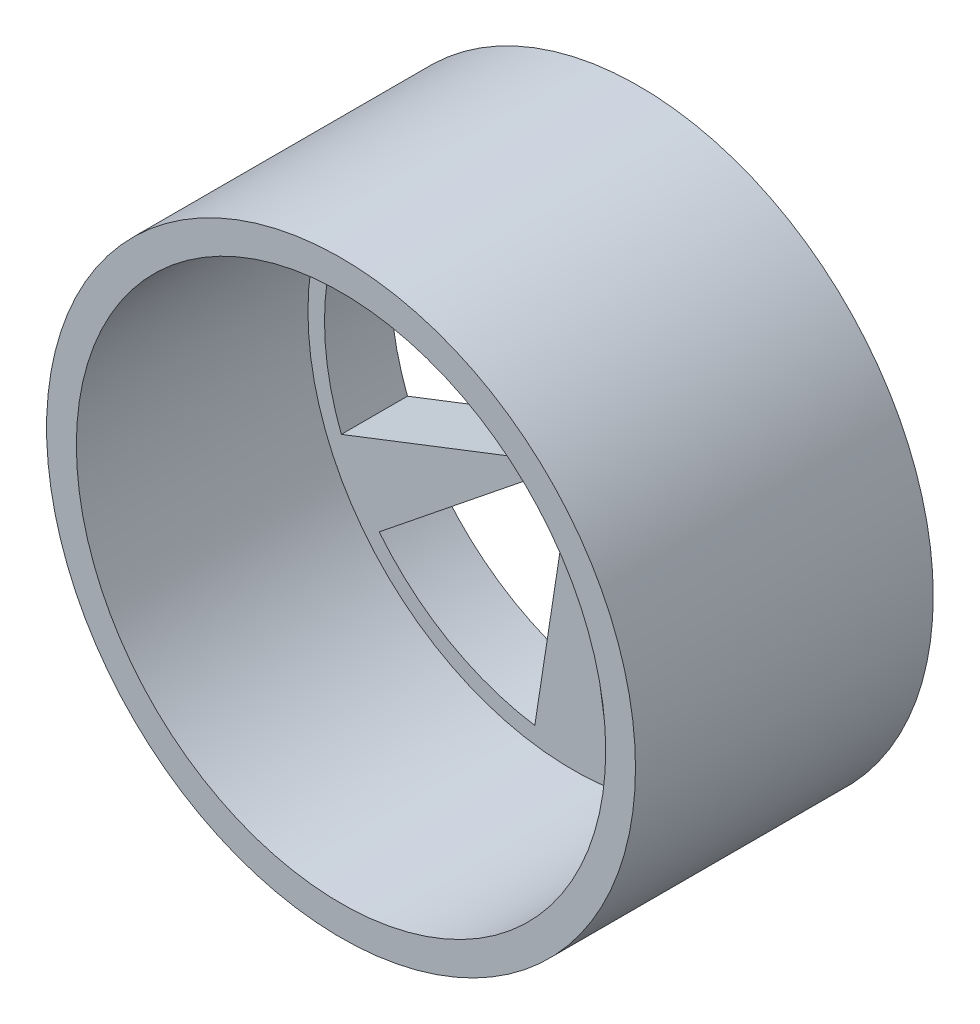
ISO-10303-21;
HEADER;
FILE_DESCRIPTION(('STEP AP214'),'2;1');
FILE_NAME('part.step','',(''),(''),'','','');
FILE_SCHEMA(('AUTOMOTIVE_DESIGN { 1 0 10303 214 1 1 1 1 }'));
ENDSEC;
DATA;
#1=APPLICATION_CONTEXT('core data for automotive mechanical design processes');
#2=APPLICATION_PROTOCOL_DEFINITION('international standard','automotive_design',2000,#1);
#3=PRODUCT_CONTEXT('',#1,'mechanical');
#4=PRODUCT('Part','Part','',(#3));
#5=PRODUCT_RELATED_PRODUCT_CATEGORY('part','',(#4));
#6=PRODUCT_DEFINITION_FORMATION('','',#4);
#7=PRODUCT_DEFINITION_CONTEXT('part definition',#1,'design');
#8=PRODUCT_DEFINITION('design','',#6,#7);
#9=PRODUCT_DEFINITION_SHAPE('','',#8);
#10=(LENGTH_UNIT() NAMED_UNIT(*) SI_UNIT(.MILLI.,.METRE.));
#11=(NAMED_UNIT(*) PLANE_ANGLE_UNIT() SI_UNIT($,.RADIAN.));
#12=(NAMED_UNIT(*) SI_UNIT($,.STERADIAN.) SOLID_ANGLE_UNIT());
#13=UNCERTAINTY_MEASURE_WITH_UNIT(LENGTH_MEASURE(1.E-05),#10,'distance_accuracy_value','');
#14=(GEOMETRIC_REPRESENTATION_CONTEXT(3) GLOBAL_UNCERTAINTY_ASSIGNED_CONTEXT((#13)) GLOBAL_UNIT_ASSIGNED_CONTEXT((#10,
#11,#12)) REPRESENTATION_CONTEXT('',''));
#15=CARTESIAN_POINT('',(0.,0.,0.));
#16=DIRECTION('',(0.,0.,1.));
#17=DIRECTION('',(1.,0.,0.));
#18=AXIS2_PLACEMENT_3D('',#15,#16,#17);
#19=CARTESIAN_POINT('',(232.735026918962,15.,-90.));
#20=DIRECTION('',(0.,0.,1.));
#21=DIRECTION('',(1.,0.,0.));
#22=AXIS2_PLACEMENT_3D('',#19,#20,#21);
#23=CYLINDRICAL_SURFACE('',#22,74.9999999999998);
#24=CARTESIAN_POINT('',(232.735026918962,15.,-70.));
#25=DIRECTION('',(0.,0.,1.));
#26=DIRECTION('',(1.,0.,0.));
#27=AXIS2_PLACEMENT_3D('',#24,#25,#26);
#28=CIRCLE('',#27,74.9999999999998);
#29=CARTESIAN_POINT('',(174.258790047296,61.9630676311577,-70.));
#30=VERTEX_POINT('',#29);
#31=CARTESIAN_POINT('',(221.301935746566,89.1234404641586,-70.));
#32=VERTEX_POINT('',#31);
#33=EDGE_CURVE('E394',#30,#32,#28,.F.);
#34=ORIENTED_EDGE('',*,*,#33,.F.);
#35=DIRECTION('',(0.,0.,1.));
#36=VECTOR('',#35,1.);
#37=CARTESIAN_POINT('',(174.258790047296,61.9630676311577,-90.));
#38=LINE('',#37,#36);
#39=CARTESIAN_POINT('',(174.258790047296,61.9630676311577,-90.));
#40=VERTEX_POINT('',#39);
#41=EDGE_CURVE('E292',#40,#30,#38,.T.);
#42=ORIENTED_EDGE('',*,*,#41,.F.);
#43=CARTESIAN_POINT('',(232.735026918962,15.,-90.));
#44=DIRECTION('',(0.,0.,1.));
#45=DIRECTION('',(1.,0.,0.));
#46=AXIS2_PLACEMENT_3D('',#43,#44,#45);
#47=CIRCLE('',#46,74.9999999999998);
#48=CARTESIAN_POINT('',(221.301935746566,89.1234404641586,-90.));
#49=VERTEX_POINT('',#48);
#50=EDGE_CURVE('E248',#49,#40,#47,.T.);
#51=ORIENTED_EDGE('',*,*,#50,.F.);
#52=DIRECTION('',(0.,0.,1.));
#53=VECTOR('',#52,1.);
#54=CARTESIAN_POINT('',(221.301935746566,89.1234404641586,-90.));
#55=LINE('',#54,#53);
#56=EDGE_CURVE('E293',#49,#32,#55,.T.);
#57=ORIENTED_EDGE('',*,*,#56,.T.);
#58=EDGE_LOOP('',(#34,#42,#51,#57));
#59=FACE_BOUND('',#58,.T.);
#60=ADVANCED_FACE('F36',(#59),#23,.F.);
#61=CARTESIAN_POINT('',(221.301935746566,89.1234404641586,-90.));
#62=DIRECTION('',(0.988312539522115,0.152441215631952,0.));
#63=DIRECTION('',(-0.152441215631952,0.988312539522115,0.));
#64=AXIS2_PLACEMENT_3D('',#61,#62,#63);
#65=PLANE('',#64);
#66=DIRECTION('',(0.152441215631952,-0.988312539522115,0.));
#67=VECTOR('',#66,1.);
#68=CARTESIAN_POINT('',(221.301935746566,89.1234404641586,-70.));
#69=LINE('',#68,#67);
#70=CARTESIAN_POINT('',(230.448408684483,29.8246880928315,-70.));
#71=VERTEX_POINT('',#70);
#72=EDGE_CURVE('E392',#32,#71,#69,.T.);
#73=ORIENTED_EDGE('',*,*,#72,.F.);
#74=ORIENTED_EDGE('',*,*,#56,.F.);
#75=DIRECTION('',(-0.152441215631952,0.988312539522115,0.));
#76=VECTOR('',#75,1.);
#77=CARTESIAN_POINT('',(221.301935746566,89.1234404641586,-90.));
#78=LINE('',#77,#76);
#79=CARTESIAN_POINT('',(230.448408684483,29.8246880928317,-90.));
#80=VERTEX_POINT('',#79);
#81=EDGE_CURVE('E289',#80,#49,#78,.T.);
#82=ORIENTED_EDGE('',*,*,#81,.F.);
#83=DIRECTION('',(0.,0.,1.));
#84=VECTOR('',#83,1.);
#85=CARTESIAN_POINT('',(230.448408684483,29.8246880928317,-90.));
#86=LINE('',#85,#84);
#87=EDGE_CURVE('E297',#80,#71,#86,.T.);
#88=ORIENTED_EDGE('',*,*,#87,.T.);
#89=EDGE_LOOP('',(#73,#74,#82,#88));
#90=FACE_BOUND('',#89,.T.);
#91=ADVANCED_FACE('F324',(#90),#65,.F.);
#92=CARTESIAN_POINT('',(232.735026918962,15.,-90.));
#93=DIRECTION('',(0.,0.,1.));
#94=DIRECTION('',(1.,0.,0.));
#95=AXIS2_PLACEMENT_3D('',#92,#93,#94);
#96=CYLINDRICAL_SURFACE('',#95,14.9999999999998);
#97=CARTESIAN_POINT('',(232.735026918962,15.,-70.));
#98=DIRECTION('',(0.,0.,1.));
#99=DIRECTION('',(1.,0.,0.));
#100=AXIS2_PLACEMENT_3D('',#97,#98,#99);
#101=CIRCLE('',#100,14.9999999999998);
#102=CARTESIAN_POINT('',(221.039779544629,24.3926135262314,-70.));
#103=VERTEX_POINT('',#102);
#104=EDGE_CURVE('E52',#71,#103,#101,.T.);
#105=ORIENTED_EDGE('',*,*,#104,.F.);
#106=ORIENTED_EDGE('',*,*,#87,.F.);
#107=CARTESIAN_POINT('',(232.735026918962,15.,-90.));
#108=DIRECTION('',(0.,0.,-1.));
#109=DIRECTION('',(1.,0.,0.));
#110=AXIS2_PLACEMENT_3D('',#107,#108,#109);
#111=CIRCLE('',#110,14.9999999999998);
#112=CARTESIAN_POINT('',(221.039779544629,24.3926135262315,-90.));
#113=VERTEX_POINT('',#112);
#114=EDGE_CURVE('E286',#113,#80,#111,.T.);
#115=ORIENTED_EDGE('',*,*,#114,.F.);
#116=DIRECTION('',(0.,0.,1.));
#117=VECTOR('',#116,1.);
#118=CARTESIAN_POINT('',(221.039779544629,24.3926135262314,-90.));
#119=LINE('',#118,#117);
#120=EDGE_CURVE('E300',#113,#103,#119,.T.);
#121=ORIENTED_EDGE('',*,*,#120,.T.);
#122=EDGE_LOOP('',(#105,#106,#115,#121));
#123=FACE_BOUND('',#122,.T.);
#124=ADVANCED_FACE('F330',(#123),#96,.T.);
#125=CARTESIAN_POINT('',(174.258790047296,61.9630676311577,-90.));
#126=DIRECTION('',(-0.626174235082108,-0.779683158288889,0.));
#127=DIRECTION('',(0.779683158288889,-0.626174235082108,0.));
#128=AXIS2_PLACEMENT_3D('',#125,#126,#127);
#129=PLANE('',#128);
#130=DIRECTION('',(-0.779683158288889,0.626174235082108,0.));
#131=VECTOR('',#130,1.);
#132=CARTESIAN_POINT('',(174.258790047296,61.9630676311577,-70.));
#133=LINE('',#132,#131);
#134=EDGE_CURVE('E389',#103,#30,#133,.T.);
#135=ORIENTED_EDGE('',*,*,#134,.F.);
#136=ORIENTED_EDGE('',*,*,#120,.F.);
#137=DIRECTION('',(0.779683158288889,-0.626174235082108,0.));
#138=VECTOR('',#137,1.);
#139=CARTESIAN_POINT('',(174.258790047296,61.9630676311577,-90.));
#140=LINE('',#139,#138);
#141=EDGE_CURVE('E283',#40,#113,#140,.T.);
#142=ORIENTED_EDGE('',*,*,#141,.F.);
#143=ORIENTED_EDGE('',*,*,#41,.T.);
#144=EDGE_LOOP('',(#135,#136,#142,#143));
#145=FACE_BOUND('',#144,.T.);
#146=ADVANCED_FACE('F335',(#145),#129,.F.);
#147=CARTESIAN_POINT('',(232.735026918962,15.,-90.));
#148=DIRECTION('',(0.,0.,1.));
#149=DIRECTION('',(1.,0.,0.));
#150=AXIS2_PLACEMENT_3D('',#147,#148,#149);
#151=CYLINDRICAL_SURFACE('',#150,75.0000000000003);
#152=CARTESIAN_POINT('',(232.735026918962,15.,-70.));
#153=DIRECTION('',(0.,0.,1.));
#154=DIRECTION('',(1.,0.,0.));
#155=AXIS2_PLACEMENT_3D('',#152,#153,#154);
#156=CIRCLE('',#155,75.0000000000003);
#157=CARTESIAN_POINT('',(302.644354963025,42.1603728330016,-70.));
#158=VERTEX_POINT('',#157);
#159=CARTESIAN_POINT('',(302.644354963026,-12.1603728329993,-70.));
#160=VERTEX_POINT('',#159);
#161=EDGE_CURVE('E387',#158,#160,#156,.F.);
#162=ORIENTED_EDGE('',*,*,#161,.F.);
#163=DIRECTION('',(0.,0.,1.));
#164=VECTOR('',#163,1.);
#165=CARTESIAN_POINT('',(302.644354963025,42.1603728330016,-90.));
#166=LINE('',#165,#164);
#167=CARTESIAN_POINT('',(302.644354963025,42.1603728330016,-90.));
#168=VERTEX_POINT('',#167);
#169=EDGE_CURVE('E408',#168,#158,#166,.T.);
#170=ORIENTED_EDGE('',*,*,#169,.F.);
#171=CARTESIAN_POINT('',(232.735026918962,15.,-90.));
#172=DIRECTION('',(0.,0.,1.));
#173=DIRECTION('',(1.,0.,0.));
#174=AXIS2_PLACEMENT_3D('',#171,#172,#173);
#175=CIRCLE('',#174,75.0000000000003);
#176=CARTESIAN_POINT('',(302.644354963026,-12.1603728329993,-90.));
#177=VERTEX_POINT('',#176);
#178=EDGE_CURVE('E396',#177,#168,#175,.T.);
#179=ORIENTED_EDGE('',*,*,#178,.F.);
#180=DIRECTION('',(0.,0.,1.));
#181=VECTOR('',#180,1.);
#182=CARTESIAN_POINT('',(302.644354963026,-12.1603728329993,-90.));
#183=LINE('',#182,#181);
#184=EDGE_CURVE('E409',#177,#160,#183,.T.);
#185=ORIENTED_EDGE('',*,*,#184,.T.);
#186=EDGE_LOOP('',(#162,#170,#179,#185));
#187=FACE_BOUND('',#186,.T.);
#188=ADVANCED_FACE('F476',(#187),#151,.F.);
#189=CARTESIAN_POINT('',(302.644354963026,-12.1603728329993,-90.));
#190=DIRECTION('',(-0.362138304439997,-0.932124373920843,0.));
#191=DIRECTION('',(0.932124373920843,-0.362138304439997,0.));
#192=AXIS2_PLACEMENT_3D('',#189,#190,#191);
#193=PLANE('',#192);
#194=DIRECTION('',(-0.932124373920843,0.362138304439997,0.));
#195=VECTOR('',#194,1.);
#196=CARTESIAN_POINT('',(302.644354963026,-12.1603728329993,-70.));
#197=LINE('',#196,#195);
#198=CARTESIAN_POINT('',(246.716892527776,9.5679254334005,-70.));
#199=VERTEX_POINT('',#198);
#200=EDGE_CURVE('E385',#160,#199,#197,.T.);
#201=ORIENTED_EDGE('',*,*,#200,.F.);
#202=ORIENTED_EDGE('',*,*,#184,.F.);
#203=DIRECTION('',(0.932124373920843,-0.362138304439997,0.));
#204=VECTOR('',#203,1.);
#205=CARTESIAN_POINT('',(302.644354963026,-12.1603728329993,-90.));
#206=LINE('',#205,#204);
#207=CARTESIAN_POINT('',(246.716892527776,9.56792543340049,-90.));
#208=VERTEX_POINT('',#207);
#209=EDGE_CURVE('E405',#208,#177,#206,.T.);
#210=ORIENTED_EDGE('',*,*,#209,.F.);
#211=DIRECTION('',(0.,0.,1.));
#212=VECTOR('',#211,1.);
#213=CARTESIAN_POINT('',(246.716892527776,9.56792543340049,-90.));
#214=LINE('',#213,#212);
#215=EDGE_CURVE('E413',#208,#199,#214,.T.);
#216=ORIENTED_EDGE('',*,*,#215,.T.);
#217=EDGE_LOOP('',(#201,#202,#210,#216));
#218=FACE_BOUND('',#217,.T.);
#219=ADVANCED_FACE('F535',(#218),#193,.F.);
#220=CARTESIAN_POINT('',(232.735026918962,15.,-90.));
#221=DIRECTION('',(0.,0.,1.));
#222=DIRECTION('',(1.,0.,0.));
#223=AXIS2_PLACEMENT_3D('',#220,#221,#222);
#224=CYLINDRICAL_SURFACE('',#223,15.0000000000003);
#225=CARTESIAN_POINT('',(232.735026918962,15.,-70.));
#226=DIRECTION('',(0.,0.,1.));
#227=DIRECTION('',(1.,0.,0.));
#228=AXIS2_PLACEMENT_3D('',#225,#226,#227);
#229=CIRCLE('',#228,15.0000000000003);
#230=CARTESIAN_POINT('',(246.716892527775,20.4320745666007,-70.));
#231=VERTEX_POINT('',#230);
#232=EDGE_CURVE('E60',#199,#231,#229,.T.);
#233=ORIENTED_EDGE('',*,*,#232,.F.);
#234=ORIENTED_EDGE('',*,*,#215,.F.);
#235=CARTESIAN_POINT('',(232.735026918962,15.,-90.));
#236=DIRECTION('',(0.,0.,-1.));
#237=DIRECTION('',(1.,0.,0.));
#238=AXIS2_PLACEMENT_3D('',#235,#236,#237);
#239=CIRCLE('',#238,15.0000000000003);
#240=CARTESIAN_POINT('',(246.716892527775,20.4320745666003,-90.));
#241=VERTEX_POINT('',#240);
#242=EDGE_CURVE('E402',#241,#208,#239,.T.);
#243=ORIENTED_EDGE('',*,*,#242,.F.);
#244=DIRECTION('',(0.,0.,1.));
#245=VECTOR('',#244,1.);
#246=CARTESIAN_POINT('',(246.716892527775,20.4320745666007,-90.));
#247=LINE('',#246,#245);
#248=EDGE_CURVE('E416',#241,#231,#247,.T.);
#249=ORIENTED_EDGE('',*,*,#248,.T.);
#250=EDGE_LOOP('',(#233,#234,#243,#249));
#251=FACE_BOUND('',#250,.T.);
#252=ADVANCED_FACE('F539',(#251),#224,.T.);
#253=CARTESIAN_POINT('',(302.644354963025,42.1603728330016,-90.));
#254=DIRECTION('',(-0.362138304440016,0.932124373920836,0.));
#255=DIRECTION('',(-0.932124373920836,-0.362138304440016,0.));
#256=AXIS2_PLACEMENT_3D('',#253,#254,#255);
#257=PLANE('',#256);
#258=DIRECTION('',(0.932124373920836,0.362138304440016,0.));
#259=VECTOR('',#258,1.);
#260=CARTESIAN_POINT('',(302.644354963025,42.1603728330016,-70.));
#261=LINE('',#260,#259);
#262=EDGE_CURVE('E382',#231,#158,#261,.T.);
#263=ORIENTED_EDGE('',*,*,#262,.F.);
#264=ORIENTED_EDGE('',*,*,#248,.F.);
#265=DIRECTION('',(-0.932124373920836,-0.362138304440016,0.));
#266=VECTOR('',#265,1.);
#267=CARTESIAN_POINT('',(302.644354963025,42.1603728330016,-90.));
#268=LINE('',#267,#266);
#269=EDGE_CURVE('E399',#168,#241,#268,.T.);
#270=ORIENTED_EDGE('',*,*,#269,.F.);
#271=ORIENTED_EDGE('',*,*,#169,.T.);
#272=EDGE_LOOP('',(#263,#264,#270,#271));
#273=FACE_BOUND('',#272,.T.);
#274=ADVANCED_FACE('F500',(#273),#257,.F.);
#275=CARTESIAN_POINT('',(232.735026918962,15.,-90.));
#276=DIRECTION('',(0.,0.,1.));
#277=DIRECTION('',(1.,0.,0.));
#278=AXIS2_PLACEMENT_3D('',#275,#276,#277);
#279=CYLINDRICAL_SURFACE('',#278,75.0000000000002);
#280=CARTESIAN_POINT('',(232.735026918962,15.,-70.));
#281=DIRECTION('',(0.,0.,1.));
#282=DIRECTION('',(1.,0.,0.));
#283=AXIS2_PLACEMENT_3D('',#280,#281,#282);
#284=CIRCLE('',#283,75.0000000000002);
#285=CARTESIAN_POINT('',(244.168118091359,89.1234404641586,-70.));
#286=VERTEX_POINT('',#285);
#287=CARTESIAN_POINT('',(291.211263790629,61.9630676311593,-70.));
#288=VERTEX_POINT('',#287);
#289=EDGE_CURVE('E380',#286,#288,#284,.F.);
#290=ORIENTED_EDGE('',*,*,#289,.F.);
#291=DIRECTION('',(0.,0.,1.));
#292=VECTOR('',#291,1.);
#293=CARTESIAN_POINT('',(244.168118091359,89.1234404641586,-90.));
#294=LINE('',#293,#292);
#295=CARTESIAN_POINT('',(244.168118091359,89.1234404641586,-90.));
#296=VERTEX_POINT('',#295);
#297=EDGE_CURVE('E244',#296,#286,#294,.T.);
#298=ORIENTED_EDGE('',*,*,#297,.F.);
#299=CARTESIAN_POINT('',(232.735026918962,15.,-90.));
#300=DIRECTION('',(0.,0.,1.));
#301=DIRECTION('',(1.,0.,0.));
#302=AXIS2_PLACEMENT_3D('',#299,#300,#301);
#303=CIRCLE('',#302,75.0000000000002);
#304=CARTESIAN_POINT('',(291.211263790629,61.9630676311594,-90.));
#305=VERTEX_POINT('',#304);
#306=EDGE_CURVE('E231',#305,#296,#303,.T.);
#307=ORIENTED_EDGE('',*,*,#306,.F.);
#308=DIRECTION('',(0.,0.,1.));
#309=VECTOR('',#308,1.);
#310=CARTESIAN_POINT('',(291.211263790629,61.9630676311594,-90.));
#311=LINE('',#310,#309);
#312=EDGE_CURVE('E245',#305,#288,#311,.T.);
#313=ORIENTED_EDGE('',*,*,#312,.T.);
#314=EDGE_LOOP('',(#290,#298,#307,#313));
#315=FACE_BOUND('',#314,.T.);
#316=ADVANCED_FACE('F496',(#315),#279,.F.);
#317=CARTESIAN_POINT('',(291.211263790629,61.9630676311594,-90.));
#318=DIRECTION('',(0.626174235082119,-0.779683158288881,0.));
#319=DIRECTION('',(0.779683158288881,0.626174235082119,0.));
#320=AXIS2_PLACEMENT_3D('',#317,#318,#319);
#321=PLANE('',#320);
#322=DIRECTION('',(-0.779683158288881,-0.626174235082119,0.));
#323=VECTOR('',#322,1.);
#324=CARTESIAN_POINT('',(291.211263790629,61.9630676311594,-70.));
#325=LINE('',#324,#323);
#326=CARTESIAN_POINT('',(244.430274293296,24.3926135262321,-70.));
#327=VERTEX_POINT('',#326);
#328=EDGE_CURVE('E378',#288,#327,#325,.T.);
#329=ORIENTED_EDGE('',*,*,#328,.F.);
#330=ORIENTED_EDGE('',*,*,#312,.F.);
#331=DIRECTION('',(0.77968315828888,0.626174235082119,0.));
#332=VECTOR('',#331,1.);
#333=CARTESIAN_POINT('',(291.211263790629,61.9630676311594,-90.));
#334=LINE('',#333,#332);
#335=CARTESIAN_POINT('',(244.430274293296,24.3926135262321,-90.));
#336=VERTEX_POINT('',#335);
#337=EDGE_CURVE('E241',#336,#305,#334,.T.);
#338=ORIENTED_EDGE('',*,*,#337,.F.);
#339=DIRECTION('',(0.,0.,1.));
#340=VECTOR('',#339,1.);
#341=CARTESIAN_POINT('',(244.430274293296,24.3926135262321,-90.));
#342=LINE('',#341,#340);
#343=EDGE_CURVE('E249',#336,#327,#342,.T.);
#344=ORIENTED_EDGE('',*,*,#343,.T.);
#345=EDGE_LOOP('',(#329,#330,#338,#344));
#346=FACE_BOUND('',#345,.T.);
#347=ADVANCED_FACE('F499',(#346),#321,.F.);
#348=CARTESIAN_POINT('',(232.735026918962,15.,-90.));
#349=DIRECTION('',(0.,0.,1.));
#350=DIRECTION('',(1.,0.,0.));
#351=AXIS2_PLACEMENT_3D('',#348,#349,#350);
#352=CYLINDRICAL_SURFACE('',#351,15.0000000000002);
#353=CARTESIAN_POINT('',(232.735026918962,15.,-70.));
#354=DIRECTION('',(0.,0.,1.));
#355=DIRECTION('',(1.,0.,0.));
#356=AXIS2_PLACEMENT_3D('',#353,#354,#355);
#357=CIRCLE('',#356,15.0000000000002);
#358=CARTESIAN_POINT('',(235.021645153442,29.8246880928317,-70.));
#359=VERTEX_POINT('',#358);
#360=EDGE_CURVE('E376',#327,#359,#357,.T.);
#361=ORIENTED_EDGE('',*,*,#360,.F.);
#362=ORIENTED_EDGE('',*,*,#343,.F.);
#363=CARTESIAN_POINT('',(232.735026918962,15.,-90.));
#364=DIRECTION('',(0.,0.,-1.));
#365=DIRECTION('',(1.,0.,0.));
#366=AXIS2_PLACEMENT_3D('',#363,#364,#365);
#367=CIRCLE('',#366,15.0000000000002);
#368=CARTESIAN_POINT('',(235.021645153442,29.8246880928317,-90.));
#369=VERTEX_POINT('',#368);
#370=EDGE_CURVE('E238',#369,#336,#367,.T.);
#371=ORIENTED_EDGE('',*,*,#370,.F.);
#372=DIRECTION('',(0.,0.,1.));
#373=VECTOR('',#372,1.);
#374=CARTESIAN_POINT('',(235.021645153442,29.8246880928317,-90.));
#375=LINE('',#374,#373);
#376=EDGE_CURVE('E252',#369,#359,#375,.T.);
#377=ORIENTED_EDGE('',*,*,#376,.T.);
#378=EDGE_LOOP('',(#361,#362,#371,#377));
#379=FACE_BOUND('',#378,.T.);
#380=ADVANCED_FACE('F504',(#379),#352,.T.);
#381=CARTESIAN_POINT('',(244.168118091359,89.1234404641586,-90.));
#382=DIRECTION('',(-0.988312539522115,0.152441215631952,0.));
#383=DIRECTION('',(-0.152441215631952,-0.988312539522115,0.));
#384=AXIS2_PLACEMENT_3D('',#381,#382,#383);
#385=PLANE('',#384);
#386=DIRECTION('',(0.152441215631952,0.988312539522115,0.));
#387=VECTOR('',#386,1.);
#388=CARTESIAN_POINT('',(244.168118091359,89.1234404641586,-70.));
#389=LINE('',#388,#387);
#390=EDGE_CURVE('E374',#359,#286,#389,.T.);
#391=ORIENTED_EDGE('',*,*,#390,.F.);
#392=ORIENTED_EDGE('',*,*,#376,.F.);
#393=DIRECTION('',(-0.152441215631952,-0.988312539522115,0.));
#394=VECTOR('',#393,1.);
#395=CARTESIAN_POINT('',(244.168118091359,89.1234404641586,-90.));
#396=LINE('',#395,#394);
#397=EDGE_CURVE('E234',#296,#369,#396,.T.);
#398=ORIENTED_EDGE('',*,*,#397,.F.);
#399=ORIENTED_EDGE('',*,*,#297,.T.);
#400=EDGE_LOOP('',(#391,#392,#398,#399));
#401=FACE_BOUND('',#400,.T.);
#402=ADVANCED_FACE('F482',(#401),#385,.F.);
#403=CARTESIAN_POINT('',(232.735026918962,15.,-90.));
#404=DIRECTION('',(0.,0.,1.));
#405=DIRECTION('',(1.,0.,0.));
#406=AXIS2_PLACEMENT_3D('',#403,#404,#405);
#407=CYLINDRICAL_SURFACE('',#406,74.9999999999996);
#408=CARTESIAN_POINT('',(232.735026918962,15.,-70.));
#409=DIRECTION('',(0.,0.,1.));
#410=DIRECTION('',(1.,0.,0.));
#411=AXIS2_PLACEMENT_3D('',#408,#409,#410);
#412=CIRCLE('',#411,74.9999999999996);
#413=CARTESIAN_POINT('',(162.8256988749,-12.160372833001,-70.));
#414=VERTEX_POINT('',#413);
#415=CARTESIAN_POINT('',(162.8256988749,42.1603728329999,-70.));
#416=VERTEX_POINT('',#415);
#417=EDGE_CURVE('E372',#414,#416,#412,.F.);
#418=ORIENTED_EDGE('',*,*,#417,.F.);
#419=DIRECTION('',(0.,0.,1.));
#420=VECTOR('',#419,1.);
#421=CARTESIAN_POINT('',(162.8256988749,-12.160372833001,-90.));
#422=LINE('',#421,#420);
#423=CARTESIAN_POINT('',(162.8256988749,-12.160372833001,-90.));
#424=VERTEX_POINT('',#423);
#425=EDGE_CURVE('E270',#424,#414,#422,.T.);
#426=ORIENTED_EDGE('',*,*,#425,.F.);
#427=CARTESIAN_POINT('',(232.735026918962,15.,-90.));
#428=DIRECTION('',(0.,0.,1.));
#429=DIRECTION('',(1.,0.,0.));
#430=AXIS2_PLACEMENT_3D('',#427,#428,#429);
#431=CIRCLE('',#430,74.9999999999996);
#432=CARTESIAN_POINT('',(162.8256988749,42.1603728329999,-90.));
#433=VERTEX_POINT('',#432);
#434=EDGE_CURVE('E257',#433,#424,#431,.T.);
#435=ORIENTED_EDGE('',*,*,#434,.F.);
#436=DIRECTION('',(0.,0.,1.));
#437=VECTOR('',#436,1.);
#438=CARTESIAN_POINT('',(162.8256988749,42.1603728329999,-90.));
#439=LINE('',#438,#437);
#440=EDGE_CURVE('E235',#433,#416,#439,.T.);
#441=ORIENTED_EDGE('',*,*,#440,.T.);
#442=EDGE_LOOP('',(#418,#426,#435,#441));
#443=FACE_BOUND('',#442,.T.);
#444=ADVANCED_FACE('F478',(#443),#407,.F.);
#445=CARTESIAN_POINT('',(162.8256988749,42.1603728329999,-90.));
#446=DIRECTION('',(0.362138304440003,0.932124373920841,0.));
#447=DIRECTION('',(-0.932124373920841,0.362138304440003,0.));
#448=AXIS2_PLACEMENT_3D('',#445,#446,#447);
#449=PLANE('',#448);
#450=DIRECTION('',(0.932124373920841,-0.362138304440003,0.));
#451=VECTOR('',#450,1.);
#452=CARTESIAN_POINT('',(162.8256988749,42.1603728329999,-70.));
#453=LINE('',#452,#451);
#454=CARTESIAN_POINT('',(218.75316131015,20.4320745665997,-70.));
#455=VERTEX_POINT('',#454);
#456=EDGE_CURVE('E370',#416,#455,#453,.T.);
#457=ORIENTED_EDGE('',*,*,#456,.F.);
#458=ORIENTED_EDGE('',*,*,#440,.F.);
#459=DIRECTION('',(-0.932124373920841,0.362138304440003,0.));
#460=VECTOR('',#459,1.);
#461=CARTESIAN_POINT('',(162.8256988749,42.1603728329999,-90.));
#462=LINE('',#461,#460);
#463=CARTESIAN_POINT('',(218.75316131015,20.4320745665997,-90.));
#464=VERTEX_POINT('',#463);
#465=EDGE_CURVE('E267',#464,#433,#462,.T.);
#466=ORIENTED_EDGE('',*,*,#465,.F.);
#467=DIRECTION('',(0.,0.,1.));
#468=VECTOR('',#467,1.);
#469=CARTESIAN_POINT('',(218.75316131015,20.4320745665997,-90.));
#470=LINE('',#469,#468);
#471=EDGE_CURVE('E273',#464,#455,#470,.T.);
#472=ORIENTED_EDGE('',*,*,#471,.T.);
#473=EDGE_LOOP('',(#457,#458,#466,#472));
#474=FACE_BOUND('',#473,.T.);
#475=ADVANCED_FACE('F481',(#474),#449,.F.);
#476=CARTESIAN_POINT('',(232.735026918962,15.,-90.));
#477=DIRECTION('',(0.,0.,1.));
#478=DIRECTION('',(1.,0.,0.));
#479=AXIS2_PLACEMENT_3D('',#476,#477,#478);
#480=CYLINDRICAL_SURFACE('',#479,14.9999999999995);
#481=CARTESIAN_POINT('',(232.735026918962,15.,-70.));
#482=DIRECTION('',(0.,0.,1.));
#483=DIRECTION('',(1.,0.,0.));
#484=AXIS2_PLACEMENT_3D('',#481,#482,#483);
#485=CIRCLE('',#484,14.9999999999995);
#486=CARTESIAN_POINT('',(218.753161310151,9.56792543339958,-70.));
#487=VERTEX_POINT('',#486);
#488=EDGE_CURVE('E368',#455,#487,#485,.T.);
#489=ORIENTED_EDGE('',*,*,#488,.F.);
#490=ORIENTED_EDGE('',*,*,#471,.F.);
#491=CARTESIAN_POINT('',(232.735026918962,15.,-90.));
#492=DIRECTION('',(0.,0.,-1.));
#493=DIRECTION('',(1.,0.,0.));
#494=AXIS2_PLACEMENT_3D('',#491,#492,#493);
#495=CIRCLE('',#494,14.9999999999995);
#496=CARTESIAN_POINT('',(218.753161310151,9.56792543340008,-90.));
#497=VERTEX_POINT('',#496);
#498=EDGE_CURVE('E264',#497,#464,#495,.T.);
#499=ORIENTED_EDGE('',*,*,#498,.F.);
#500=DIRECTION('',(0.,0.,1.));
#501=VECTOR('',#500,1.);
#502=CARTESIAN_POINT('',(218.753161310151,9.56792543339958,-90.));
#503=LINE('',#502,#501);
#504=EDGE_CURVE('E276',#497,#487,#503,.T.);
#505=ORIENTED_EDGE('',*,*,#504,.T.);
#506=EDGE_LOOP('',(#489,#490,#499,#505));
#507=FACE_BOUND('',#506,.T.);
#508=ADVANCED_FACE('F488',(#507),#480,.T.);
#509=CARTESIAN_POINT('',(162.8256988749,-12.160372833001,-90.));
#510=DIRECTION('',(0.36213830444001,-0.932124373920838,0.));
#511=DIRECTION('',(0.932124373920838,0.36213830444001,0.));
#512=AXIS2_PLACEMENT_3D('',#509,#510,#511);
#513=PLANE('',#512);
#514=DIRECTION('',(-0.932124373920838,-0.36213830444001,0.));
#515=VECTOR('',#514,1.);
#516=CARTESIAN_POINT('',(162.8256988749,-12.160372833001,-70.));
#517=LINE('',#516,#515);
#518=EDGE_CURVE('E366',#487,#414,#517,.T.);
#519=ORIENTED_EDGE('',*,*,#518,.F.);
#520=ORIENTED_EDGE('',*,*,#504,.F.);
#521=DIRECTION('',(0.932124373920838,0.36213830444001,0.));
#522=VECTOR('',#521,1.);
#523=CARTESIAN_POINT('',(162.8256988749,-12.160372833001,-90.));
#524=LINE('',#523,#522);
#525=EDGE_CURVE('E260',#424,#497,#524,.T.);
#526=ORIENTED_EDGE('',*,*,#525,.F.);
#527=ORIENTED_EDGE('',*,*,#425,.T.);
#528=EDGE_LOOP('',(#519,#520,#526,#527));
#529=FACE_BOUND('',#528,.T.);
#530=ADVANCED_FACE('F484',(#529),#513,.F.);
#531=CARTESIAN_POINT('',(232.735026918962,15.,-90.));
#532=DIRECTION('',(0.,0.,1.));
#533=DIRECTION('',(1.,0.,0.));
#534=AXIS2_PLACEMENT_3D('',#531,#532,#533);
#535=CYLINDRICAL_SURFACE('',#534,74.9999999999997);
#536=CARTESIAN_POINT('',(232.735026918962,15.,-70.));
#537=DIRECTION('',(0.,0.,1.));
#538=DIRECTION('',(1.,0.,0.));
#539=AXIS2_PLACEMENT_3D('',#536,#537,#538);
#540=CIRCLE('',#539,74.9999999999997);
#541=CARTESIAN_POINT('',(221.301935746567,-59.1234404641586,-70.));
#542=VERTEX_POINT('',#541);
#543=CARTESIAN_POINT('',(174.258790047297,-31.9630676311588,-70.));
#544=VERTEX_POINT('',#543);
#545=EDGE_CURVE('E364',#542,#544,#540,.F.);
#546=ORIENTED_EDGE('',*,*,#545,.F.);
#547=DIRECTION('',(0.,0.,1.));
#548=VECTOR('',#547,1.);
#549=CARTESIAN_POINT('',(221.301935746567,-59.1234404641586,-90.));
#550=LINE('',#549,#548);
#551=CARTESIAN_POINT('',(221.301935746567,-59.1234404641586,-90.));
#552=VERTEX_POINT('',#551);
#553=EDGE_CURVE('E433',#552,#542,#550,.T.);
#554=ORIENTED_EDGE('',*,*,#553,.F.);
#555=CARTESIAN_POINT('',(232.735026918962,15.,-90.));
#556=DIRECTION('',(0.,0.,1.));
#557=DIRECTION('',(1.,0.,0.));
#558=AXIS2_PLACEMENT_3D('',#555,#556,#557);
#559=CIRCLE('',#558,74.9999999999997);
#560=CARTESIAN_POINT('',(174.258790047297,-31.9630676311588,-90.));
#561=VERTEX_POINT('',#560);
#562=EDGE_CURVE('E421',#561,#552,#559,.T.);
#563=ORIENTED_EDGE('',*,*,#562,.F.);
#564=DIRECTION('',(0.,0.,1.));
#565=VECTOR('',#564,1.);
#566=CARTESIAN_POINT('',(174.258790047297,-31.9630676311588,-90.));
#567=LINE('',#566,#565);
#568=EDGE_CURVE('E261',#561,#544,#567,.T.);
#569=ORIENTED_EDGE('',*,*,#568,.T.);
#570=EDGE_LOOP('',(#546,#554,#563,#569));
#571=FACE_BOUND('',#570,.T.);
#572=ADVANCED_FACE('F487',(#571),#535,.F.);
#573=CARTESIAN_POINT('',(174.258790047297,-31.9630676311588,-90.));
#574=DIRECTION('',(-0.626174235082114,0.779683158288884,0.));
#575=DIRECTION('',(-0.779683158288885,-0.626174235082114,0.));
#576=AXIS2_PLACEMENT_3D('',#573,#574,#575);
#577=PLANE('',#576);
#578=DIRECTION('',(0.779683158288885,0.626174235082114,0.));
#579=VECTOR('',#578,1.);
#580=CARTESIAN_POINT('',(174.258790047297,-31.9630676311588,-70.));
#581=LINE('',#580,#579);
#582=CARTESIAN_POINT('',(221.03977954463,5.607386473768,-70.));
#583=VERTEX_POINT('',#582);
#584=EDGE_CURVE('E362',#544,#583,#581,.T.);
#585=ORIENTED_EDGE('',*,*,#584,.F.);
#586=ORIENTED_EDGE('',*,*,#568,.F.);
#587=DIRECTION('',(-0.779683158288885,-0.626174235082114,0.));
#588=VECTOR('',#587,1.);
#589=CARTESIAN_POINT('',(174.258790047297,-31.9630676311588,-90.));
#590=LINE('',#589,#588);
#591=CARTESIAN_POINT('',(221.03977954463,5.60738647376804,-90.));
#592=VERTEX_POINT('',#591);
#593=EDGE_CURVE('E430',#592,#561,#590,.T.);
#594=ORIENTED_EDGE('',*,*,#593,.F.);
#595=DIRECTION('',(0.,0.,1.));
#596=VECTOR('',#595,1.);
#597=CARTESIAN_POINT('',(221.03977954463,5.60738647376804,-90.));
#598=LINE('',#597,#596);
#599=EDGE_CURVE('E436',#592,#583,#598,.T.);
#600=ORIENTED_EDGE('',*,*,#599,.T.);
#601=EDGE_LOOP('',(#585,#586,#594,#600));
#602=FACE_BOUND('',#601,.T.);
#603=ADVANCED_FACE('F521',(#602),#577,.F.);
#604=CARTESIAN_POINT('',(232.735026918962,15.,-90.));
#605=DIRECTION('',(0.,0.,1.));
#606=DIRECTION('',(1.,0.,0.));
#607=AXIS2_PLACEMENT_3D('',#604,#605,#606);
#608=CYLINDRICAL_SURFACE('',#607,14.9999999999997);
#609=CARTESIAN_POINT('',(232.735026918962,15.,-70.));
#610=DIRECTION('',(0.,0.,1.));
#611=DIRECTION('',(1.,0.,0.));
#612=AXIS2_PLACEMENT_3D('',#609,#610,#611);
#613=CIRCLE('',#612,14.9999999999997);
#614=CARTESIAN_POINT('',(230.448408684484,0.175311907168442,-70.));
#615=VERTEX_POINT('',#614);
#616=EDGE_CURVE('E360',#583,#615,#613,.T.);
#617=ORIENTED_EDGE('',*,*,#616,.F.);
#618=ORIENTED_EDGE('',*,*,#599,.F.);
#619=CARTESIAN_POINT('',(232.735026918962,15.,-90.));
#620=DIRECTION('',(0.,0.,-1.));
#621=DIRECTION('',(1.,0.,0.));
#622=AXIS2_PLACEMENT_3D('',#619,#620,#621);
#623=CIRCLE('',#622,14.9999999999997);
#624=CARTESIAN_POINT('',(230.448408684483,0.175311907168442,-90.));
#625=VERTEX_POINT('',#624);
#626=EDGE_CURVE('E427',#625,#592,#623,.T.);
#627=ORIENTED_EDGE('',*,*,#626,.F.);
#628=DIRECTION('',(0.,0.,1.));
#629=VECTOR('',#628,1.);
#630=CARTESIAN_POINT('',(230.448408684484,0.175311907168442,-90.));
#631=LINE('',#630,#629);
#632=EDGE_CURVE('E439',#625,#615,#631,.T.);
#633=ORIENTED_EDGE('',*,*,#632,.T.);
#634=EDGE_LOOP('',(#617,#618,#627,#633));
#635=FACE_BOUND('',#634,.T.);
#636=ADVANCED_FACE('F525',(#635),#608,.T.);
#637=CARTESIAN_POINT('',(221.301935746567,-59.1234404641586,-90.));
#638=DIRECTION('',(0.988312539522116,-0.152441215631946,0.));
#639=DIRECTION('',(0.152441215631946,0.988312539522116,0.));
#640=AXIS2_PLACEMENT_3D('',#637,#638,#639);
#641=PLANE('',#640);
#642=DIRECTION('',(-0.152441215631946,-0.988312539522116,0.));
#643=VECTOR('',#642,1.);
#644=CARTESIAN_POINT('',(221.301935746567,-59.1234404641586,-70.));
#645=LINE('',#644,#643);
#646=EDGE_CURVE('E214',#615,#542,#645,.T.);
#647=ORIENTED_EDGE('',*,*,#646,.F.);
#648=ORIENTED_EDGE('',*,*,#632,.F.);
#649=DIRECTION('',(0.152441215631946,0.988312539522116,0.));
#650=VECTOR('',#649,1.);
#651=CARTESIAN_POINT('',(221.301935746567,-59.1234404641586,-90.));
#652=LINE('',#651,#650);
#653=EDGE_CURVE('E424',#552,#625,#652,.T.);
#654=ORIENTED_EDGE('',*,*,#653,.F.);
#655=ORIENTED_EDGE('',*,*,#553,.T.);
#656=EDGE_LOOP('',(#647,#648,#654,#655));
#657=FACE_BOUND('',#656,.T.);
#658=ADVANCED_FACE('F513',(#657),#641,.F.);
#659=CARTESIAN_POINT('',(232.735026918962,15.,-90.));
#660=DIRECTION('',(0.,0.,1.));
#661=DIRECTION('',(1.,0.,0.));
#662=AXIS2_PLACEMENT_3D('',#659,#660,#661);
#663=CYLINDRICAL_SURFACE('',#662,75.0000000000001);
#664=CARTESIAN_POINT('',(232.735026918962,15.,-70.));
#665=DIRECTION('',(0.,0.,1.));
#666=DIRECTION('',(1.,0.,0.));
#667=AXIS2_PLACEMENT_3D('',#664,#665,#666);
#668=CIRCLE('',#667,75.0000000000001);
#669=CARTESIAN_POINT('',(291.21126379063,-31.9630676311573,-70.));
#670=VERTEX_POINT('',#669);
#671=CARTESIAN_POINT('',(244.16811809136,-59.1234404641584,-70.));
#672=VERTEX_POINT('',#671);
#673=EDGE_CURVE('E199',#670,#672,#668,.F.);
#674=ORIENTED_EDGE('',*,*,#673,.F.);
#675=DIRECTION('',(0.,0.,1.));
#676=VECTOR('',#675,1.);
#677=CARTESIAN_POINT('',(291.21126379063,-31.9630676311573,-90.));
#678=LINE('',#677,#676);
#679=CARTESIAN_POINT('',(291.21126379063,-31.9630676311573,-90.));
#680=VERTEX_POINT('',#679);
#681=EDGE_CURVE('E211',#680,#670,#678,.T.);
#682=ORIENTED_EDGE('',*,*,#681,.F.);
#683=CARTESIAN_POINT('',(232.735026918962,15.,-90.));
#684=DIRECTION('',(0.,0.,1.));
#685=DIRECTION('',(1.,0.,0.));
#686=AXIS2_PLACEMENT_3D('',#683,#684,#685);
#687=CIRCLE('',#686,75.0000000000001);
#688=CARTESIAN_POINT('',(244.16811809136,-59.1234404641584,-90.));
#689=VERTEX_POINT('',#688);
#690=EDGE_CURVE('E412',#689,#680,#687,.T.);
#691=ORIENTED_EDGE('',*,*,#690,.F.);
#692=DIRECTION('',(0.,0.,1.));
#693=VECTOR('',#692,1.);
#694=CARTESIAN_POINT('',(244.16811809136,-59.1234404641584,-90.));
#695=LINE('',#694,#693);
#696=EDGE_CURVE('E213',#689,#672,#695,.T.);
#697=ORIENTED_EDGE('',*,*,#696,.T.);
#698=EDGE_LOOP('',(#674,#682,#691,#697));
#699=FACE_BOUND('',#698,.T.);
#700=ADVANCED_FACE('F209',(#699),#663,.F.);
#701=CARTESIAN_POINT('',(244.16811809136,-59.1234404641584,-90.));
#702=DIRECTION('',(-0.988312539522114,-0.152441215631959,0.));
#703=DIRECTION('',(0.152441215631959,-0.988312539522114,0.));
#704=AXIS2_PLACEMENT_3D('',#701,#702,#703);
#705=PLANE('',#704);
#706=DIRECTION('',(-0.152441215631959,0.988312539522114,0.));
#707=VECTOR('',#706,1.);
#708=CARTESIAN_POINT('',(244.16811809136,-59.1234404641584,-70.));
#709=LINE('',#708,#707);
#710=CARTESIAN_POINT('',(235.021645153443,0.175311907168322,-70.));
#711=VERTEX_POINT('',#710);
#712=EDGE_CURVE('E215',#672,#711,#709,.T.);
#713=ORIENTED_EDGE('',*,*,#712,.F.);
#714=ORIENTED_EDGE('',*,*,#696,.F.);
#715=DIRECTION('',(0.152441215631959,-0.988312539522114,0.));
#716=VECTOR('',#715,1.);
#717=CARTESIAN_POINT('',(244.16811809136,-59.1234404641584,-90.));
#718=LINE('',#717,#716);
#719=CARTESIAN_POINT('',(235.021645153443,0.175311907168411,-90.));
#720=VERTEX_POINT('',#719);
#721=EDGE_CURVE('E222',#720,#689,#718,.T.);
#722=ORIENTED_EDGE('',*,*,#721,.F.);
#723=DIRECTION('',(0.,0.,1.));
#724=VECTOR('',#723,1.);
#725=CARTESIAN_POINT('',(235.021645153443,0.175311907168411,-90.));
#726=LINE('',#725,#724);
#727=EDGE_CURVE('E224',#720,#711,#726,.T.);
#728=ORIENTED_EDGE('',*,*,#727,.T.);
#729=EDGE_LOOP('',(#713,#714,#722,#728));
#730=FACE_BOUND('',#729,.T.);
#731=ADVANCED_FACE('F451',(#730),#705,.F.);
#732=CARTESIAN_POINT('',(232.735026918962,15.,-90.));
#733=DIRECTION('',(0.,0.,1.));
#734=DIRECTION('',(1.,0.,0.));
#735=AXIS2_PLACEMENT_3D('',#732,#733,#734);
#736=CYLINDRICAL_SURFACE('',#735,15.0000000000001);
#737=CARTESIAN_POINT('',(232.735026918962,15.,-70.));
#738=DIRECTION('',(0.,0.,1.));
#739=DIRECTION('',(1.,0.,0.));
#740=AXIS2_PLACEMENT_3D('',#737,#738,#739);
#741=CIRCLE('',#740,15.0000000000001);
#742=CARTESIAN_POINT('',(244.430274293296,5.60738647376896,-70.));
#743=VERTEX_POINT('',#742);
#744=EDGE_CURVE('E202',#711,#743,#741,.T.);
#745=ORIENTED_EDGE('',*,*,#744,.F.);
#746=ORIENTED_EDGE('',*,*,#727,.F.);
#747=CARTESIAN_POINT('',(232.735026918962,15.,-90.));
#748=DIRECTION('',(0.,0.,-1.));
#749=DIRECTION('',(1.,0.,0.));
#750=AXIS2_PLACEMENT_3D('',#747,#748,#749);
#751=CIRCLE('',#750,15.0000000000001);
#752=CARTESIAN_POINT('',(244.430274293296,5.60738647376804,-90.));
#753=VERTEX_POINT('',#752);
#754=EDGE_CURVE('E227',#753,#720,#751,.T.);
#755=ORIENTED_EDGE('',*,*,#754,.F.);
#756=DIRECTION('',(0.,0.,1.));
#757=VECTOR('',#756,1.);
#758=CARTESIAN_POINT('',(244.430274293296,5.60738647376896,-90.));
#759=LINE('',#758,#757);
#760=EDGE_CURVE('E221',#753,#743,#759,.T.);
#761=ORIENTED_EDGE('',*,*,#760,.T.);
#762=EDGE_LOOP('',(#745,#746,#755,#761));
#763=FACE_BOUND('',#762,.T.);
#764=ADVANCED_FACE('F321',(#763),#736,.T.);
#765=CARTESIAN_POINT('',(291.21126379063,-31.9630676311573,-90.));
#766=DIRECTION('',(0.626174235082103,0.779683158288893,0.));
#767=DIRECTION('',(-0.779683158288893,0.626174235082103,0.));
#768=AXIS2_PLACEMENT_3D('',#765,#766,#767);
#769=PLANE('',#768);
#770=DIRECTION('',(0.779683158288893,-0.626174235082103,0.));
#771=VECTOR('',#770,1.);
#772=CARTESIAN_POINT('',(291.21126379063,-31.9630676311573,-70.));
#773=LINE('',#772,#771);
#774=EDGE_CURVE('E11',#743,#670,#773,.T.);
#775=ORIENTED_EDGE('',*,*,#774,.F.);
#776=ORIENTED_EDGE('',*,*,#760,.F.);
#777=DIRECTION('',(-0.779683158288893,0.626174235082103,0.));
#778=VECTOR('',#777,1.);
#779=CARTESIAN_POINT('',(291.21126379063,-31.9630676311573,-90.));
#780=LINE('',#779,#778);
#781=EDGE_CURVE('E219',#680,#753,#780,.T.);
#782=ORIENTED_EDGE('',*,*,#781,.F.);
#783=ORIENTED_EDGE('',*,*,#681,.T.);
#784=EDGE_LOOP('',(#775,#776,#782,#783));
#785=FACE_BOUND('',#784,.T.);
#786=ADVANCED_FACE('F217',(#785),#769,.F.);
#787=CARTESIAN_POINT('',(232.735026918962,15.,-90.));
#788=DIRECTION('',(0.,0.,1.));
#789=DIRECTION('',(1.,0.,0.));
#790=AXIS2_PLACEMENT_3D('',#787,#788,#789);
#791=CYLINDRICAL_SURFACE('',#790,89.);
#792=CARTESIAN_POINT('',(232.735026918962,15.,-90.));
#793=DIRECTION('',(0.,0.,1.));
#794=DIRECTION('',(1.,0.,0.));
#795=AXIS2_PLACEMENT_3D('',#792,#793,#794);
#796=CIRCLE('',#795,89.);
#797=CARTESIAN_POINT('',(321.735026918962,15.,-90.));
#798=VERTEX_POINT('',#797);
#799=EDGE_CURVE('E45',#798,#798,#796,.T.);
#800=ORIENTED_EDGE('',*,*,#799,.T.);
#801=EDGE_LOOP('',(#800));
#802=FACE_BOUND('',#801,.T.);
#803=CARTESIAN_POINT('',(232.735026918962,15.,0.));
#804=DIRECTION('',(0.,0.,1.));
#805=DIRECTION('',(1.,0.,0.));
#806=AXIS2_PLACEMENT_3D('',#803,#804,#805);
#807=CIRCLE('',#806,89.);
#808=CARTESIAN_POINT('',(321.735026918962,15.,0.));
#809=VERTEX_POINT('',#808);
#810=EDGE_CURVE('E296',#809,#809,#807,.T.);
#811=ORIENTED_EDGE('',*,*,#810,.F.);
#812=EDGE_LOOP('',(#811));
#813=FACE_BOUND('',#812,.T.);
#814=ADVANCED_FACE('F38',(#802,#813),#791,.T.);
#815=CARTESIAN_POINT('',(232.735026918962,15.,-90.));
#816=DIRECTION('',(0.,0.,1.));
#817=DIRECTION('',(1.,0.,0.));
#818=AXIS2_PLACEMENT_3D('',#815,#816,#817);
#819=PLANE('',#818);
#820=CARTESIAN_POINT('',(232.735026918962,15.,-90.));
#821=DIRECTION('',(0.,0.,-1.));
#822=DIRECTION('',(-1.,0.,0.));
#823=AXIS2_PLACEMENT_3D('',#820,#821,#822);
#824=CIRCLE('',#823,10.);
#825=CARTESIAN_POINT('',(222.735026918962,15.,-90.));
#826=VERTEX_POINT('',#825);
#827=EDGE_CURVE('E354',#826,#826,#824,.T.);
#828=ORIENTED_EDGE('',*,*,#827,.F.);
#829=EDGE_LOOP('',(#828));
#830=FACE_BOUND('',#829,.T.);
#831=ORIENTED_EDGE('',*,*,#721,.T.);
#832=ORIENTED_EDGE('',*,*,#690,.T.);
#833=ORIENTED_EDGE('',*,*,#781,.T.);
#834=ORIENTED_EDGE('',*,*,#754,.T.);
#835=EDGE_LOOP('',(#831,#832,#833,#834));
#836=FACE_BOUND('',#835,.T.);
#837=ORIENTED_EDGE('',*,*,#593,.T.);
#838=ORIENTED_EDGE('',*,*,#562,.T.);
#839=ORIENTED_EDGE('',*,*,#653,.T.);
#840=ORIENTED_EDGE('',*,*,#626,.T.);
#841=EDGE_LOOP('',(#837,#838,#839,#840));
#842=FACE_BOUND('',#841,.T.);
#843=ORIENTED_EDGE('',*,*,#465,.T.);
#844=ORIENTED_EDGE('',*,*,#434,.T.);
#845=ORIENTED_EDGE('',*,*,#525,.T.);
#846=ORIENTED_EDGE('',*,*,#498,.T.);
#847=EDGE_LOOP('',(#843,#844,#845,#846));
#848=FACE_BOUND('',#847,.T.);
#849=ORIENTED_EDGE('',*,*,#337,.T.);
#850=ORIENTED_EDGE('',*,*,#306,.T.);
#851=ORIENTED_EDGE('',*,*,#397,.T.);
#852=ORIENTED_EDGE('',*,*,#370,.T.);
#853=EDGE_LOOP('',(#849,#850,#851,#852));
#854=FACE_BOUND('',#853,.T.);
#855=ORIENTED_EDGE('',*,*,#209,.T.);
#856=ORIENTED_EDGE('',*,*,#178,.T.);
#857=ORIENTED_EDGE('',*,*,#269,.T.);
#858=ORIENTED_EDGE('',*,*,#242,.T.);
#859=EDGE_LOOP('',(#855,#856,#857,#858));
#860=FACE_BOUND('',#859,.T.);
#861=ORIENTED_EDGE('',*,*,#81,.T.);
#862=ORIENTED_EDGE('',*,*,#50,.T.);
#863=ORIENTED_EDGE('',*,*,#141,.T.);
#864=ORIENTED_EDGE('',*,*,#114,.T.);
#865=EDGE_LOOP('',(#861,#862,#863,#864));
#866=FACE_BOUND('',#865,.T.);
#867=ORIENTED_EDGE('',*,*,#799,.F.);
#868=EDGE_LOOP('',(#867));
#869=FACE_BOUND('',#868,.T.);
#870=ADVANCED_FACE('F313',(#830,#836,#842,#848,#854,#860,#866,#869),#819,.F.);
#871=CARTESIAN_POINT('',(232.735026918962,15.,0.));
#872=DIRECTION('',(0.,0.,1.));
#873=DIRECTION('',(1.,0.,0.));
#874=AXIS2_PLACEMENT_3D('',#871,#872,#873);
#875=PLANE('',#874);
#876=CARTESIAN_POINT('',(232.735026918962,15.,0.));
#877=DIRECTION('',(0.,0.,1.));
#878=DIRECTION('',(1.,0.,0.));
#879=AXIS2_PLACEMENT_3D('',#876,#877,#878);
#880=CIRCLE('',#879,80.);
#881=CARTESIAN_POINT('',(312.735026918962,15.,0.));
#882=VERTEX_POINT('',#881);
#883=EDGE_CURVE('E347',#882,#882,#880,.T.);
#884=ORIENTED_EDGE('',*,*,#883,.F.);
#885=EDGE_LOOP('',(#884));
#886=FACE_BOUND('',#885,.T.);
#887=ORIENTED_EDGE('',*,*,#810,.T.);
#888=EDGE_LOOP('',(#887));
#889=FACE_BOUND('',#888,.T.);
#890=ADVANCED_FACE('F310',(#886,#889),#875,.T.);
#891=CARTESIAN_POINT('',(232.735026918962,15.,-70.));
#892=DIRECTION('',(0.,0.,1.));
#893=DIRECTION('',(1.,0.,0.));
#894=AXIS2_PLACEMENT_3D('',#891,#892,#893);
#895=PLANE('',#894);
#896=CARTESIAN_POINT('',(232.735026918962,15.,-70.));
#897=DIRECTION('',(0.,0.,1.));
#898=DIRECTION('',(1.,0.,0.));
#899=AXIS2_PLACEMENT_3D('',#896,#897,#898);
#900=CIRCLE('',#899,10.);
#901=CARTESIAN_POINT('',(242.735026918963,15.,-70.));
#902=VERTEX_POINT('',#901);
#903=EDGE_CURVE('E40',#902,#902,#900,.T.);
#904=ORIENTED_EDGE('',*,*,#903,.F.);
#905=EDGE_LOOP('',(#904));
#906=FACE_BOUND('',#905,.T.);
#907=ORIENTED_EDGE('',*,*,#161,.T.);
#908=ORIENTED_EDGE('',*,*,#200,.T.);
#909=ORIENTED_EDGE('',*,*,#232,.T.);
#910=ORIENTED_EDGE('',*,*,#262,.T.);
#911=EDGE_LOOP('',(#907,#908,#909,#910));
#912=FACE_BOUND('',#911,.T.);
#913=ORIENTED_EDGE('',*,*,#417,.T.);
#914=ORIENTED_EDGE('',*,*,#456,.T.);
#915=ORIENTED_EDGE('',*,*,#488,.T.);
#916=ORIENTED_EDGE('',*,*,#518,.T.);
#917=EDGE_LOOP('',(#913,#914,#915,#916));
#918=FACE_BOUND('',#917,.T.);
#919=ORIENTED_EDGE('',*,*,#673,.T.);
#920=ORIENTED_EDGE('',*,*,#712,.T.);
#921=ORIENTED_EDGE('',*,*,#744,.T.);
#922=ORIENTED_EDGE('',*,*,#774,.T.);
#923=EDGE_LOOP('',(#919,#920,#921,#922));
#924=FACE_BOUND('',#923,.T.);
#925=CARTESIAN_POINT('',(232.735026918962,15.,-70.));
#926=DIRECTION('',(0.,0.,1.));
#927=DIRECTION('',(1.,0.,0.));
#928=AXIS2_PLACEMENT_3D('',#925,#926,#927);
#929=CIRCLE('',#928,80.);
#930=CARTESIAN_POINT('',(312.735026918962,15.,-70.));
#931=VERTEX_POINT('',#930);
#932=EDGE_CURVE('E349',#931,#931,#929,.T.);
#933=ORIENTED_EDGE('',*,*,#932,.T.);
#934=EDGE_LOOP('',(#933));
#935=FACE_BOUND('',#934,.T.);
#936=ORIENTED_EDGE('',*,*,#545,.T.);
#937=ORIENTED_EDGE('',*,*,#584,.T.);
#938=ORIENTED_EDGE('',*,*,#616,.T.);
#939=ORIENTED_EDGE('',*,*,#646,.T.);
#940=EDGE_LOOP('',(#936,#937,#938,#939));
#941=FACE_BOUND('',#940,.T.);
#942=ORIENTED_EDGE('',*,*,#289,.T.);
#943=ORIENTED_EDGE('',*,*,#328,.T.);
#944=ORIENTED_EDGE('',*,*,#360,.T.);
#945=ORIENTED_EDGE('',*,*,#390,.T.);
#946=EDGE_LOOP('',(#942,#943,#944,#945));
#947=FACE_BOUND('',#946,.T.);
#948=ORIENTED_EDGE('',*,*,#33,.T.);
#949=ORIENTED_EDGE('',*,*,#72,.T.);
#950=ORIENTED_EDGE('',*,*,#104,.T.);
#951=ORIENTED_EDGE('',*,*,#134,.T.);
#952=EDGE_LOOP('',(#948,#949,#950,#951));
#953=FACE_BOUND('',#952,.T.);
#954=ADVANCED_FACE('F197',(#906,#912,#918,#924,#935,#941,#947,#953),#895,.T.);
#955=CARTESIAN_POINT('',(232.735026918962,15.,-70.));
#956=DIRECTION('',(0.,0.,1.));
#957=DIRECTION('',(1.,0.,0.));
#958=AXIS2_PLACEMENT_3D('',#955,#956,#957);
#959=CYLINDRICAL_SURFACE('',#958,80.);
#960=ORIENTED_EDGE('',*,*,#932,.F.);
#961=EDGE_LOOP('',(#960));
#962=FACE_BOUND('',#961,.T.);
#963=ORIENTED_EDGE('',*,*,#883,.T.);
#964=EDGE_LOOP('',(#963));
#965=FACE_BOUND('',#964,.T.);
#966=ADVANCED_FACE('F342',(#962,#965),#959,.F.);
#967=CARTESIAN_POINT('',(232.735026918962,15.,0.));
#968=DIRECTION('',(0.,0.,-1.));
#969=DIRECTION('',(-1.,0.,0.));
#970=AXIS2_PLACEMENT_3D('',#967,#968,#969);
#971=CYLINDRICAL_SURFACE('',#970,10.);
#972=ORIENTED_EDGE('',*,*,#903,.T.);
#973=EDGE_LOOP('',(#972));
#974=FACE_BOUND('',#973,.T.);
#975=ORIENTED_EDGE('',*,*,#827,.T.);
#976=EDGE_LOOP('',(#975));
#977=FACE_BOUND('',#976,.T.);
#978=ADVANCED_FACE('F548',(#974,#977),#971,.F.);
#979=CLOSED_SHELL('',(#60,#91,#124,#146,#188,#219,#252,#274,#316,#347,#380,#402,#444,#475,#508,
#530,#572,#603,#636,#658,#700,#731,#764,#786,#814,#870,#890,#954,#966,#978));
#980=MANIFOLD_SOLID_BREP('B2',#979);
#981=ADVANCED_BREP_SHAPE_REPRESENTATION('',(#18,#980),#14);
#982=SHAPE_DEFINITION_REPRESENTATION(#9,#981);
ENDSEC;
END-ISO-10303-21;
